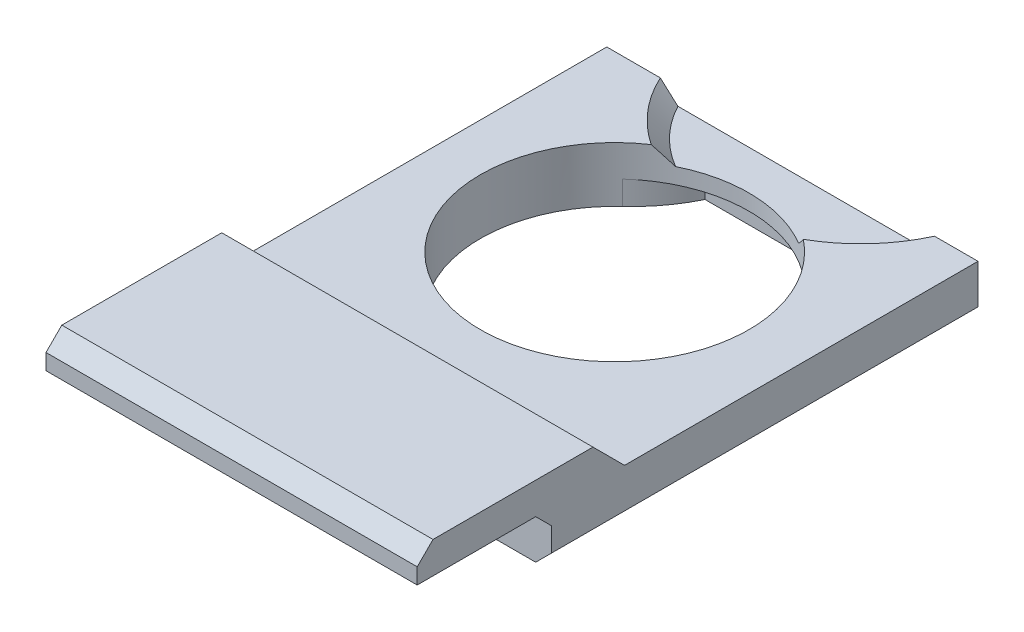
ISO-10303-21;
HEADER;
FILE_DESCRIPTION(('STEP AP214'),'2;1');
FILE_NAME('part.step','',(''),(''),'','','');
FILE_SCHEMA(('AUTOMOTIVE_DESIGN { 1 0 10303 214 1 1 1 1 }'));
ENDSEC;
DATA;
#1=APPLICATION_CONTEXT('core data for automotive mechanical design processes');
#2=APPLICATION_PROTOCOL_DEFINITION('international standard','automotive_design',2000,#1);
#3=PRODUCT_CONTEXT('',#1,'mechanical');
#4=PRODUCT('Part','Part','',(#3));
#5=PRODUCT_RELATED_PRODUCT_CATEGORY('part','',(#4));
#6=PRODUCT_DEFINITION_FORMATION('','',#4);
#7=PRODUCT_DEFINITION_CONTEXT('part definition',#1,'design');
#8=PRODUCT_DEFINITION('design','',#6,#7);
#9=PRODUCT_DEFINITION_SHAPE('','',#8);
#10=(LENGTH_UNIT() NAMED_UNIT(*) SI_UNIT(.MILLI.,.METRE.));
#11=(NAMED_UNIT(*) PLANE_ANGLE_UNIT() SI_UNIT($,.RADIAN.));
#12=(NAMED_UNIT(*) SI_UNIT($,.STERADIAN.) SOLID_ANGLE_UNIT());
#13=UNCERTAINTY_MEASURE_WITH_UNIT(LENGTH_MEASURE(1.E-05),#10,'distance_accuracy_value','');
#14=(GEOMETRIC_REPRESENTATION_CONTEXT(3) GLOBAL_UNCERTAINTY_ASSIGNED_CONTEXT((#13)) GLOBAL_UNIT_ASSIGNED_CONTEXT((#10,
#11,#12)) REPRESENTATION_CONTEXT('',''));
#15=CARTESIAN_POINT('',(0.,0.,0.));
#16=DIRECTION('',(0.,0.,1.));
#17=DIRECTION('',(1.,0.,0.));
#18=AXIS2_PLACEMENT_3D('',#15,#16,#17);
#19=CARTESIAN_POINT('',(-13.2043973941368,3.5,-11.1596091205212));
#20=DIRECTION('',(1.,0.,0.));
#21=DIRECTION('',(0.,0.,-1.));
#22=AXIS2_PLACEMENT_3D('',#19,#20,#21);
#23=PLANE('',#22);
#24=DIRECTION('',(0.,-1.,0.));
#25=VECTOR('',#24,1.);
#26=CARTESIAN_POINT('',(-13.2043973941368,5.5,25.3403908794788));
#27=LINE('',#26,#25);
#28=CARTESIAN_POINT('',(-13.2043973941368,4.50000000000001,25.3403908794788));
#29=VERTEX_POINT('',#28);
#30=CARTESIAN_POINT('',(-13.2043973941368,3.5,25.3403908794788));
#31=VERTEX_POINT('',#30);
#32=EDGE_CURVE('E177',#29,#31,#27,.T.);
#33=ORIENTED_EDGE('',*,*,#32,.F.);
#34=DIRECTION('',(0.,-0.707106781186545,0.70710678118655));
#35=VECTOR('',#34,1.);
#36=CARTESIAN_POINT('',(-13.2043973941368,4.5,25.3403908794788));
#37=LINE('',#36,#35);
#38=CARTESIAN_POINT('',(-13.2043973941368,5.5,24.3403908794788));
#39=VERTEX_POINT('',#38);
#40=EDGE_CURVE('E55',#29,#39,#37,.F.);
#41=ORIENTED_EDGE('',*,*,#40,.T.);
#42=DIRECTION('',(0.,0.,1.));
#43=VECTOR('',#42,1.);
#44=CARTESIAN_POINT('',(-13.2043973941368,5.5,14.2138990897864));
#45=LINE('',#44,#43);
#46=CARTESIAN_POINT('',(-13.2043973941368,5.5,14.2138990897864));
#47=VERTEX_POINT('',#46);
#48=EDGE_CURVE('E325',#47,#39,#45,.T.);
#49=ORIENTED_EDGE('',*,*,#48,.F.);
#50=DIRECTION('',(0.,-0.707106781186552,-0.707106781186543));
#51=VECTOR('',#50,1.);
#52=CARTESIAN_POINT('',(-13.2043973941368,-8.18675410515378,0.527144984632768));
#53=LINE('',#52,#51);
#54=CARTESIAN_POINT('',(-13.2043973941368,3.5,12.2138990897864));
#55=VERTEX_POINT('',#54);
#56=EDGE_CURVE('E190',#47,#55,#53,.T.);
#57=ORIENTED_EDGE('',*,*,#56,.T.);
#58=DIRECTION('',(0.,0.,1.));
#59=VECTOR('',#58,1.);
#60=CARTESIAN_POINT('',(-13.2043973941368,3.5,-11.1596091205212));
#61=LINE('',#60,#59);
#62=CARTESIAN_POINT('',(-13.2043973941368,3.5,-10.1596091205212));
#63=VERTEX_POINT('',#62);
#64=EDGE_CURVE('E183',#63,#55,#61,.T.);
#65=ORIENTED_EDGE('',*,*,#64,.F.);
#66=DIRECTION('',(0.,-1.,0.));
#67=VECTOR('',#66,1.);
#68=CARTESIAN_POINT('',(-13.2043973941368,3.5,-10.1596091205212));
#69=LINE('',#68,#67);
#70=CARTESIAN_POINT('',(-13.2043973941368,1.00000000000001,-10.1596091205212));
#71=VERTEX_POINT('',#70);
#72=EDGE_CURVE('E168',#63,#71,#69,.T.);
#73=ORIENTED_EDGE('',*,*,#72,.T.);
#74=DIRECTION('',(0.,0.,1.));
#75=VECTOR('',#74,1.);
#76=CARTESIAN_POINT('',(-13.2043973941368,1.00000000000001,-11.1596091205212));
#77=LINE('',#76,#75);
#78=CARTESIAN_POINT('',(-13.2043973941368,1.00000000000001,16.8403908794788));
#79=VERTEX_POINT('',#78);
#80=EDGE_CURVE('E209',#71,#79,#77,.T.);
#81=ORIENTED_EDGE('',*,*,#80,.T.);
#82=DIRECTION('',(0.,-1.,0.));
#83=VECTOR('',#82,1.);
#84=CARTESIAN_POINT('',(-13.2043973941368,3.5,16.8403908794788));
#85=LINE('',#84,#83);
#86=CARTESIAN_POINT('',(-13.2043973941368,2.50000000000001,16.8403908794788));
#87=VERTEX_POINT('',#86);
#88=EDGE_CURVE('E206',#87,#79,#85,.T.);
#89=ORIENTED_EDGE('',*,*,#88,.F.);
#90=DIRECTION('',(0.,-0.707106781186543,-0.707106781186552));
#91=VECTOR('',#90,1.);
#92=CARTESIAN_POINT('',(-13.2043973941368,-11.,3.34039087947863));
#93=LINE('',#92,#91);
#94=CARTESIAN_POINT('',(-13.2043973941368,3.5,17.8403908794788));
#95=VERTEX_POINT('',#94);
#96=EDGE_CURVE('E366',#87,#95,#93,.F.);
#97=ORIENTED_EDGE('',*,*,#96,.T.);
#98=DIRECTION('',(0.,0.,1.));
#99=VECTOR('',#98,1.);
#100=CARTESIAN_POINT('',(-13.2043973941368,3.5,14.2138990897864));
#101=LINE('',#100,#99);
#102=EDGE_CURVE('E306',#95,#31,#101,.T.);
#103=ORIENTED_EDGE('',*,*,#102,.T.);
#104=EDGE_LOOP('',(#33,#41,#49,#57,#65,#73,#81,#89,#97,#103));
#105=FACE_BOUND('',#104,.T.);
#106=ADVANCED_FACE('F33',(#105),#23,.F.);
#107=CARTESIAN_POINT('',(-13.2043973941368,3.5,16.8403908794788));
#108=DIRECTION('',(0.,0.,-1.));
#109=DIRECTION('',(-1.,0.,0.));
#110=AXIS2_PLACEMENT_3D('',#107,#108,#109);
#111=PLANE('',#110);
#112=DIRECTION('',(0.,-1.,0.));
#113=VECTOR('',#112,1.);
#114=CARTESIAN_POINT('',(10.2956026058632,3.5,16.8403908794788));
#115=LINE('',#114,#113);
#116=CARTESIAN_POINT('',(10.2956026058632,2.50000000000001,16.8403908794788));
#117=VERTEX_POINT('',#116);
#118=CARTESIAN_POINT('',(10.2956026058632,1.00000000000001,16.8403908794788));
#119=VERTEX_POINT('',#118);
#120=EDGE_CURVE('E196',#117,#119,#115,.T.);
#121=ORIENTED_EDGE('',*,*,#120,.F.);
#122=DIRECTION('',(-1.,0.,0.));
#123=VECTOR('',#122,1.);
#124=CARTESIAN_POINT('',(-13.2043973941368,2.50000000000001,16.8403908794788));
#125=LINE('',#124,#123);
#126=EDGE_CURVE('E362',#117,#87,#125,.T.);
#127=ORIENTED_EDGE('',*,*,#126,.T.);
#128=ORIENTED_EDGE('',*,*,#88,.T.);
#129=DIRECTION('',(-0.707106781186548,0.707106781186547,0.));
#130=VECTOR('',#129,1.);
#131=CARTESIAN_POINT('',(-13.2043973941368,1.00000000000001,16.8403908794788));
#132=LINE('',#131,#130);
#133=CARTESIAN_POINT('',(-12.2043973941368,0.,16.8403908794788));
#134=VERTEX_POINT('',#133);
#135=EDGE_CURVE('E214',#79,#134,#132,.F.);
#136=ORIENTED_EDGE('',*,*,#135,.T.);
#137=DIRECTION('',(1.,0.,0.));
#138=VECTOR('',#137,1.);
#139=CARTESIAN_POINT('',(-13.2043973941368,0.,16.8403908794788));
#140=LINE('',#139,#138);
#141=CARTESIAN_POINT('',(9.29560260586319,0.,16.8403908794788));
#142=VERTEX_POINT('',#141);
#143=EDGE_CURVE('E193',#134,#142,#140,.T.);
#144=ORIENTED_EDGE('',*,*,#143,.T.);
#145=DIRECTION('',(-0.707106781186547,-0.707106781186548,0.));
#146=VECTOR('',#145,1.);
#147=CARTESIAN_POINT('',(10.2956026058632,1.00000000000001,16.8403908794788));
#148=LINE('',#147,#146);
#149=EDGE_CURVE('E211',#142,#119,#148,.F.);
#150=ORIENTED_EDGE('',*,*,#149,.T.);
#151=EDGE_LOOP('',(#121,#127,#128,#136,#144,#150));
#152=FACE_BOUND('',#151,.T.);
#153=ADVANCED_FACE('F409',(#152),#111,.F.);
#154=CARTESIAN_POINT('',(10.2956026058632,3.5,-11.1596091205212));
#155=DIRECTION('',(-1.,0.,0.));
#156=DIRECTION('',(0.,0.,1.));
#157=AXIS2_PLACEMENT_3D('',#154,#155,#156);
#158=PLANE('',#157);
#159=DIRECTION('',(0.,0.,-1.));
#160=VECTOR('',#159,1.);
#161=CARTESIAN_POINT('',(10.2956026058632,5.5,14.2138990897864));
#162=LINE('',#161,#160);
#163=CARTESIAN_POINT('',(10.2956026058632,5.5,24.3403908794788));
#164=VERTEX_POINT('',#163);
#165=CARTESIAN_POINT('',(10.2956026058632,5.5,14.2138990897864));
#166=VERTEX_POINT('',#165);
#167=EDGE_CURVE('E327',#164,#166,#162,.T.);
#168=ORIENTED_EDGE('',*,*,#167,.F.);
#169=DIRECTION('',(0.,0.707106781186545,-0.70710678118655));
#170=VECTOR('',#169,1.);
#171=CARTESIAN_POINT('',(10.2956026058632,4.50000000000001,25.3403908794788));
#172=LINE('',#171,#170);
#173=CARTESIAN_POINT('',(10.2956026058632,4.50000000000001,25.3403908794788));
#174=VERTEX_POINT('',#173);
#175=EDGE_CURVE('E11',#164,#174,#172,.F.);
#176=ORIENTED_EDGE('',*,*,#175,.T.);
#177=DIRECTION('',(0.,1.,0.));
#178=VECTOR('',#177,1.);
#179=CARTESIAN_POINT('',(10.2956026058632,3.5,25.3403908794788));
#180=LINE('',#179,#178);
#181=CARTESIAN_POINT('',(10.2956026058632,3.5,25.3403908794788));
#182=VERTEX_POINT('',#181);
#183=EDGE_CURVE('E302',#182,#174,#180,.T.);
#184=ORIENTED_EDGE('',*,*,#183,.F.);
#185=DIRECTION('',(0.,0.,-1.));
#186=VECTOR('',#185,1.);
#187=CARTESIAN_POINT('',(10.2956026058632,3.5,14.2138990897864));
#188=LINE('',#187,#186);
#189=CARTESIAN_POINT('',(10.2956026058632,3.5,17.8403908794788));
#190=VERTEX_POINT('',#189);
#191=EDGE_CURVE('E328',#182,#190,#188,.T.);
#192=ORIENTED_EDGE('',*,*,#191,.T.);
#193=DIRECTION('',(0.,0.707106781186543,0.707106781186552));
#194=VECTOR('',#193,1.);
#195=CARTESIAN_POINT('',(10.2956026058632,-11.,3.34039087947863));
#196=LINE('',#195,#194);
#197=EDGE_CURVE('E364',#190,#117,#196,.F.);
#198=ORIENTED_EDGE('',*,*,#197,.T.);
#199=ORIENTED_EDGE('',*,*,#120,.T.);
#200=DIRECTION('',(0.,0.,-1.));
#201=VECTOR('',#200,1.);
#202=CARTESIAN_POINT('',(10.2956026058632,1.00000000000001,-11.1596091205212));
#203=LINE('',#202,#201);
#204=CARTESIAN_POINT('',(10.2956026058632,1.00000000000001,-10.1596091205212));
#205=VERTEX_POINT('',#204);
#206=EDGE_CURVE('E224',#119,#205,#203,.T.);
#207=ORIENTED_EDGE('',*,*,#206,.T.);
#208=DIRECTION('',(0.,1.,0.));
#209=VECTOR('',#208,1.);
#210=CARTESIAN_POINT('',(10.2956026058632,3.5,-10.1596091205212));
#211=LINE('',#210,#209);
#212=CARTESIAN_POINT('',(10.2956026058632,3.5,-10.1596091205212));
#213=VERTEX_POINT('',#212);
#214=EDGE_CURVE('E178',#205,#213,#211,.T.);
#215=ORIENTED_EDGE('',*,*,#214,.T.);
#216=DIRECTION('',(0.,0.,-1.));
#217=VECTOR('',#216,1.);
#218=CARTESIAN_POINT('',(10.2956026058632,3.5,-11.1596091205212));
#219=LINE('',#218,#217);
#220=CARTESIAN_POINT('',(10.2956026058632,3.5,12.2138990897864));
#221=VERTEX_POINT('',#220);
#222=EDGE_CURVE('E192',#221,#213,#219,.T.);
#223=ORIENTED_EDGE('',*,*,#222,.F.);
#224=DIRECTION('',(0.,0.707106781186552,0.707106781186543));
#225=VECTOR('',#224,1.);
#226=CARTESIAN_POINT('',(10.2956026058632,-8.18675410515378,0.527144984632768));
#227=LINE('',#226,#225);
#228=EDGE_CURVE('E354',#221,#166,#227,.T.);
#229=ORIENTED_EDGE('',*,*,#228,.T.);
#230=EDGE_LOOP('',(#168,#176,#184,#192,#198,#199,#207,#215,#223,#229));
#231=FACE_BOUND('',#230,.T.);
#232=ADVANCED_FACE('F416',(#231),#158,.F.);
#233=CARTESIAN_POINT('',(0.,3.5,0.));
#234=DIRECTION('',(0.,1.,0.));
#235=DIRECTION('',(0.,0.,1.));
#236=AXIS2_PLACEMENT_3D('',#233,#234,#235);
#237=PLANE('',#236);
#238=DIRECTION('',(1.,0.,0.));
#239=VECTOR('',#238,1.);
#240=CARTESIAN_POINT('',(-14.6352200640106,3.5,-10.1596091205212));
#241=LINE('',#240,#239);
#242=CARTESIAN_POINT('',(-9.81490170414816,3.5,-10.1596091205212));
#243=VERTEX_POINT('',#242);
#244=EDGE_CURVE('E171',#63,#243,#241,.T.);
#245=ORIENTED_EDGE('',*,*,#244,.F.);
#246=ORIENTED_EDGE('',*,*,#64,.T.);
#247=DIRECTION('',(1.,0.,0.));
#248=VECTOR('',#247,1.);
#249=CARTESIAN_POINT('',(0.,3.5,12.2138990897864));
#250=LINE('',#249,#248);
#251=EDGE_CURVE('E352',#55,#221,#250,.T.);
#252=ORIENTED_EDGE('',*,*,#251,.T.);
#253=ORIENTED_EDGE('',*,*,#222,.T.);
#254=CARTESIAN_POINT('',(7.54431576864198,3.5,-10.1596091205212));
#255=VERTEX_POINT('',#254);
#256=EDGE_CURVE('E188',#255,#213,#241,.T.);
#257=ORIENTED_EDGE('',*,*,#256,.F.);
#258=CARTESIAN_POINT('',(-1.13529296775309,3.5,-14.156160388649));
#259=DIRECTION('',(0.,1.,0.));
#260=DIRECTION('',(0.,0.,1.));
#261=AXIS2_PLACEMENT_3D('',#258,#259,#260);
#262=CIRCLE('',#261,9.55552352598639);
#263=CARTESIAN_POINT('',(3.55954339458981,3.5,-5.83350808385439));
#264=VERTEX_POINT('',#263);
#265=EDGE_CURVE('E336',#264,#255,#262,.T.);
#266=ORIENTED_EDGE('',*,*,#265,.F.);
#267=CARTESIAN_POINT('',(-1.7043973941368,3.5,0.84039087947883));
#268=DIRECTION('',(0.,1.,0.));
#269=DIRECTION('',(0.,0.,1.));
#270=AXIS2_PLACEMENT_3D('',#267,#268,#269);
#271=CIRCLE('',#270,8.5);
#272=CARTESIAN_POINT('',(-6.44739106245475,3.5,-6.2132614412906));
#273=VERTEX_POINT('',#272);
#274=EDGE_CURVE('E202',#273,#264,#271,.T.);
#275=ORIENTED_EDGE('',*,*,#274,.F.);
#276=EDGE_CURVE('E186',#243,#273,#262,.T.);
#277=ORIENTED_EDGE('',*,*,#276,.F.);
#278=EDGE_LOOP('',(#245,#246,#252,#253,#257,#266,#275,#277));
#279=FACE_BOUND('',#278,.T.);
#280=ADVANCED_FACE('F182',(#279),#237,.T.);
#281=CARTESIAN_POINT('',(0.,0.,0.));
#282=DIRECTION('',(0.,1.,0.));
#283=DIRECTION('',(0.,0.,1.));
#284=AXIS2_PLACEMENT_3D('',#281,#282,#283);
#285=PLANE('',#284);
#286=CARTESIAN_POINT('',(-1.7043973941368,0.,0.84039087947883));
#287=DIRECTION('',(0.,1.,0.));
#288=DIRECTION('',(0.,0.,1.));
#289=AXIS2_PLACEMENT_3D('',#286,#287,#288);
#290=CIRCLE('',#289,8.5);
#291=CARTESIAN_POINT('',(-7.45664462827733,0.,-5.41753623397676));
#292=VERTEX_POINT('',#291);
#293=CARTESIAN_POINT('',(4.40570664310773,0.,-5.06863853778151));
#294=VERTEX_POINT('',#293);
#295=EDGE_CURVE('E199',#292,#294,#290,.T.);
#296=ORIENTED_EDGE('',*,*,#295,.T.);
#297=CARTESIAN_POINT('',(11.5940643339836,0.,-12.0204378522054));
#298=DIRECTION('',(0.,1.,0.));
#299=DIRECTION('',(0.,0.,1.));
#300=AXIS2_PLACEMENT_3D('',#297,#298,#299);
#301=CIRCLE('',#300,10.);
#302=CARTESIAN_POINT('',(2.2706048550285,0.,-8.40476317874802));
#303=VERTEX_POINT('',#302);
#304=EDGE_CURVE('E378',#294,#303,#301,.F.);
#305=ORIENTED_EDGE('',*,*,#304,.T.);
#306=DIRECTION('',(1.,0.,0.));
#307=VECTOR('',#306,1.);
#308=CARTESIAN_POINT('',(-5.23182979117824,0.,-8.40476317874802));
#309=LINE('',#308,#307);
#310=CARTESIAN_POINT('',(-5.23182979117824,0.,-8.40476317874802));
#311=VERTEX_POINT('',#310);
#312=EDGE_CURVE('E314',#311,#303,#309,.T.);
#313=ORIENTED_EDGE('',*,*,#312,.F.);
#314=CARTESIAN_POINT('',(-14.2239943155015,0.,-12.7798034262775));
#315=DIRECTION('',(0.,1.,0.));
#316=DIRECTION('',(0.,0.,1.));
#317=AXIS2_PLACEMENT_3D('',#314,#315,#316);
#318=CIRCLE('',#317,10.);
#319=EDGE_CURVE('E376',#311,#292,#318,.F.);
#320=ORIENTED_EDGE('',*,*,#319,.T.);
#321=EDGE_LOOP('',(#296,#305,#313,#320));
#322=FACE_BOUND('',#321,.T.);
#323=ORIENTED_EDGE('',*,*,#143,.F.);
#324=DIRECTION('',(0.,0.,-1.));
#325=VECTOR('',#324,1.);
#326=CARTESIAN_POINT('',(-12.2043973941368,0.,0.));
#327=LINE('',#326,#325);
#328=CARTESIAN_POINT('',(-12.2043973941368,0.,-10.1596091205212));
#329=VERTEX_POINT('',#328);
#330=EDGE_CURVE('E221',#134,#329,#327,.T.);
#331=ORIENTED_EDGE('',*,*,#330,.T.);
#332=DIRECTION('',(1.,0.,0.));
#333=VECTOR('',#332,1.);
#334=CARTESIAN_POINT('',(0.,0.,-10.1596091205212));
#335=LINE('',#334,#333);
#336=CARTESIAN_POINT('',(9.29560260586318,0.,-10.1596091205212));
#337=VERTEX_POINT('',#336);
#338=EDGE_CURVE('E216',#329,#337,#335,.T.);
#339=ORIENTED_EDGE('',*,*,#338,.T.);
#340=DIRECTION('',(0.,0.,1.));
#341=VECTOR('',#340,1.);
#342=CARTESIAN_POINT('',(9.29560260586319,0.,0.));
#343=LINE('',#342,#341);
#344=EDGE_CURVE('E219',#337,#142,#343,.T.);
#345=ORIENTED_EDGE('',*,*,#344,.T.);
#346=EDGE_LOOP('',(#323,#331,#339,#345));
#347=FACE_BOUND('',#346,.T.);
#348=ADVANCED_FACE('F395',(#322,#347),#285,.F.);
#349=CARTESIAN_POINT('',(10.2956026058632,1.00000000000001,-11.1596091205212));
#350=DIRECTION('',(-0.707106781186548,0.707106781186547,0.));
#351=DIRECTION('',(0.,0.,-1.));
#352=AXIS2_PLACEMENT_3D('',#349,#350,#351);
#353=PLANE('',#352);
#354=DIRECTION('',(0.707106781186547,0.707106781186548,0.));
#355=VECTOR('',#354,1.);
#356=CARTESIAN_POINT('',(10.2956026058632,1.00000000000001,-10.1596091205212));
#357=LINE('',#356,#355);
#358=EDGE_CURVE('E431',#205,#337,#357,.F.);
#359=ORIENTED_EDGE('',*,*,#358,.F.);
#360=ORIENTED_EDGE('',*,*,#206,.F.);
#361=ORIENTED_EDGE('',*,*,#149,.F.);
#362=ORIENTED_EDGE('',*,*,#344,.F.);
#363=EDGE_LOOP('',(#359,#360,#361,#362));
#364=FACE_BOUND('',#363,.T.);
#365=ADVANCED_FACE('F261',(#364),#353,.F.);
#366=CARTESIAN_POINT('',(-13.2043973941368,1.00000000000001,-11.1596091205212));
#367=DIRECTION('',(0.707106781186547,0.707106781186548,0.));
#368=DIRECTION('',(0.,0.,1.));
#369=AXIS2_PLACEMENT_3D('',#366,#367,#368);
#370=PLANE('',#369);
#371=DIRECTION('',(0.707106781186548,-0.707106781186547,0.));
#372=VECTOR('',#371,1.);
#373=CARTESIAN_POINT('',(-13.2043973941368,1.00000000000001,-10.1596091205212));
#374=LINE('',#373,#372);
#375=EDGE_CURVE('E174',#329,#71,#374,.F.);
#376=ORIENTED_EDGE('',*,*,#375,.F.);
#377=ORIENTED_EDGE('',*,*,#330,.F.);
#378=ORIENTED_EDGE('',*,*,#135,.F.);
#379=ORIENTED_EDGE('',*,*,#80,.F.);
#380=EDGE_LOOP('',(#376,#377,#378,#379));
#381=FACE_BOUND('',#380,.T.);
#382=ADVANCED_FACE('F420',(#381),#370,.F.);
#383=CARTESIAN_POINT('',(-1.7043973941368,0.,0.84039087947883));
#384=DIRECTION('',(0.,1.,0.));
#385=DIRECTION('',(0.,0.,1.));
#386=AXIS2_PLACEMENT_3D('',#383,#384,#385);
#387=CYLINDRICAL_SURFACE('',#386,8.5);
#388=CARTESIAN_POINT('',(-1.7043973941368,1.5,0.84039087947883));
#389=DIRECTION('',(0.,-1.,0.));
#390=DIRECTION('',(0.,0.,-1.));
#391=AXIS2_PLACEMENT_3D('',#388,#389,#390);
#392=CIRCLE('',#391,8.5);
#393=CARTESIAN_POINT('',(4.40570664310773,1.5,-5.06863853778151));
#394=VERTEX_POINT('',#393);
#395=CARTESIAN_POINT('',(-7.45664462827733,1.5,-5.41753623397676));
#396=VERTEX_POINT('',#395);
#397=EDGE_CURVE('E368',#394,#396,#392,.F.);
#398=ORIENTED_EDGE('',*,*,#397,.F.);
#399=DIRECTION('',(0.,1.,0.));
#400=VECTOR('',#399,1.);
#401=CARTESIAN_POINT('',(4.40570664310773,0.,-5.06863853778151));
#402=LINE('',#401,#400);
#403=EDGE_CURVE('E373',#394,#294,#402,.F.);
#404=ORIENTED_EDGE('',*,*,#403,.T.);
#405=ORIENTED_EDGE('',*,*,#295,.F.);
#406=DIRECTION('',(0.,1.,0.));
#407=VECTOR('',#406,1.);
#408=CARTESIAN_POINT('',(-7.45664462827733,0.,-5.41753623397677));
#409=LINE('',#408,#407);
#410=EDGE_CURVE('E370',#292,#396,#409,.T.);
#411=ORIENTED_EDGE('',*,*,#410,.T.);
#412=EDGE_LOOP('',(#398,#404,#405,#411));
#413=FACE_BOUND('',#412,.T.);
#414=CARTESIAN_POINT('',(-1.7043973941368,2.5,0.84039087947883));
#415=DIRECTION('',(0.,1.,0.));
#416=DIRECTION('',(0.,0.,1.));
#417=AXIS2_PLACEMENT_3D('',#414,#415,#416);
#418=CIRCLE('',#417,8.5);
#419=CARTESIAN_POINT('',(-5.46996487151153,2.5,-6.7800094757084));
#420=VERTEX_POINT('',#419);
#421=CARTESIAN_POINT('',(2.62788160012487,2.5,-6.472704136715));
#422=VERTEX_POINT('',#421);
#423=EDGE_CURVE('E227',#420,#422,#418,.F.);
#424=ORIENTED_EDGE('',*,*,#423,.F.);
#425=CARTESIAN_POINT('',(-5.46996487151153,2.5,-6.7800094757084));
#426=CARTESIAN_POINT('',(-5.5565180628324,2.5807372621746,-6.73723590520001));
#427=CARTESIAN_POINT('',(-5.64173468220181,2.66227915489309,-6.69329587227077));
#428=CARTESIAN_POINT('',(-5.80953683062387,2.82668126865164,-6.60319074845282));
#429=CARTESIAN_POINT('',(-5.8921243465626,2.9095404196041,-6.55702740743434));
#430=CARTESIAN_POINT('',(-6.05484211397301,3.07640986642587,-6.46251819375757));
#431=CARTESIAN_POINT('',(-6.13497242522833,3.16042013421651,-6.41417237426971));
#432=CARTESIAN_POINT('',(-6.29291715507688,3.32948536183602,-6.31531752007123));
#433=CARTESIAN_POINT('',(-6.37072973069077,3.41454108085537,-6.26480683787722));
#434=CARTESIAN_POINT('',(-6.44739106245475,3.49999999999999,-6.2132614412906));
#435=B_SPLINE_CURVE_WITH_KNOTS('',3,(#425,#426,#427,#428,#429,#430,#431,#432,#433,#434),
.UNSPECIFIED.,.F.,.F.,(4,2,2,2,4),(0.,0.377541116833015,0.754789794255524,1.1320292859479,
1.50956114354248),.UNSPECIFIED.);
#436=EDGE_CURVE('E243',#420,#273,#435,.T.);
#437=ORIENTED_EDGE('',*,*,#436,.T.);
#438=ORIENTED_EDGE('',*,*,#274,.T.);
#439=CARTESIAN_POINT('',(3.55954339458982,3.50000000000001,-5.83350808385439));
#440=CARTESIAN_POINT('',(3.48700911820646,3.41454108085538,-5.89071530758217));
#441=CARTESIAN_POINT('',(3.41324848922202,3.32948536183603,-5.94697804437299));
#442=CARTESIAN_POINT('',(3.26325012659319,3.16042013421652,-6.05751903719559));
#443=CARTESIAN_POINT('',(3.18701435548847,3.07640986642588,-6.11179879629506));
#444=CARTESIAN_POINT('',(3.03192733180787,2.90954041960411,-6.21836839039544));
#445=CARTESIAN_POINT('',(2.95307601559056,2.82668126865165,-6.27065817690979));
#446=CARTESIAN_POINT('',(2.79258545305707,2.66227915489309,-6.37322168743372));
#447=CARTESIAN_POINT('',(2.71094409294859,2.5807372621746,-6.4234938171898));
#448=CARTESIAN_POINT('',(2.62788160012487,2.5,-6.472704136715));
#449=B_SPLINE_CURVE_WITH_KNOTS('',3,(#439,#440,#441,#442,#443,#444,#445,#446,#447,#448),
.UNSPECIFIED.,.F.,.F.,(4,2,2,2,4),(0.,0.377531857594592,0.754771349286969,1.13202002670948,
1.5095611435425),.UNSPECIFIED.);
#450=EDGE_CURVE('E235',#264,#422,#449,.T.);
#451=ORIENTED_EDGE('',*,*,#450,.T.);
#452=EDGE_LOOP('',(#424,#437,#438,#451));
#453=FACE_BOUND('',#452,.T.);
#454=ADVANCED_FACE('F250',(#413,#453),#387,.F.);
#455=CARTESIAN_POINT('',(-1.13529296775309,2.5,-14.156160388649));
#456=DIRECTION('',(0.,1.,0.));
#457=DIRECTION('',(0.,0.,1.));
#458=AXIS2_PLACEMENT_3D('',#455,#456,#457);
#459=PLANE('',#458);
#460=DIRECTION('',(1.,0.,0.));
#461=VECTOR('',#460,1.);
#462=CARTESIAN_POINT('',(-1.13529296775309,2.5,-10.1596091205212));
#463=LINE('',#462,#461);
#464=CARTESIAN_POINT('',(-8.69998468420345,2.5,-10.1596091205212));
#465=VERTEX_POINT('',#464);
#466=CARTESIAN_POINT('',(6.42939874869726,2.5,-10.1596091205212));
#467=VERTEX_POINT('',#466);
#468=EDGE_CURVE('E187',#465,#467,#463,.T.);
#469=ORIENTED_EDGE('',*,*,#468,.F.);
#470=CARTESIAN_POINT('',(-1.13529296775309,2.5,-14.156160388649));
#471=DIRECTION('',(0.,1.,0.));
#472=DIRECTION('',(0.,0.,1.));
#473=AXIS2_PLACEMENT_3D('',#470,#471,#472);
#474=CIRCLE('',#473,8.55552352598639);
#475=EDGE_CURVE('E230',#465,#420,#474,.T.);
#476=ORIENTED_EDGE('',*,*,#475,.T.);
#477=ORIENTED_EDGE('',*,*,#423,.T.);
#478=CARTESIAN_POINT('',(-1.13529296775309,2.5,-14.156160388649));
#479=DIRECTION('',(0.,1.,0.));
#480=DIRECTION('',(0.,0.,1.));
#481=AXIS2_PLACEMENT_3D('',#478,#479,#480);
#482=CIRCLE('',#481,8.55552352598638);
#483=EDGE_CURVE('E232',#422,#467,#482,.T.);
#484=ORIENTED_EDGE('',*,*,#483,.T.);
#485=EDGE_LOOP('',(#469,#476,#477,#484));
#486=FACE_BOUND('',#485,.T.);
#487=ADVANCED_FACE('F259',(#486),#459,.T.);
#488=CARTESIAN_POINT('',(-1.13529296775309,2.5,-14.156160388649));
#489=DIRECTION('',(0.,1.,0.));
#490=DIRECTION('',(0.,0.,1.));
#491=AXIS2_PLACEMENT_3D('',#488,#489,#490);
#492=CONICAL_SURFACE('',#491,8.55552352598638,0.785398163397453);
#493=ORIENTED_EDGE('',*,*,#265,.T.);
#494=CARTESIAN_POINT('',(13.7188372006737,9.32685616960494,-10.1596091205212));
#495=CARTESIAN_POINT('',(13.4182541457885,9.03660730458298,-10.1596091205212));
#496=CARTESIAN_POINT('',(13.1173848433068,8.7466541174739,-10.1596091205212));
#497=CARTESIAN_POINT('',(12.5149306242305,8.16748780255645,-10.1596091205212));
#498=CARTESIAN_POINT('',(12.2133457023688,7.87827468022789,-10.1596091205212));
#499=CARTESIAN_POINT('',(11.6092560738988,7.30067887470176,-10.1596091205212));
#500=CARTESIAN_POINT('',(11.3067511820307,7.01229638516827,-10.1596091205212));
#501=CARTESIAN_POINT('',(10.7006943567166,6.43663505306381,-10.1596091205212));
#502=CARTESIAN_POINT('',(10.3971424265138,6.1493562070803,-10.1596091205212));
#503=CARTESIAN_POINT('',(9.78913255136098,5.5765489420484,-10.1596091205212));
#504=CARTESIAN_POINT('',(9.48467628975255,5.29101873738336,-10.1596091205212));
#505=CARTESIAN_POINT('',(8.8741297946306,4.72171108678027,-10.1596091205212));
#506=CARTESIAN_POINT('',(8.56803956705258,4.43793363448328,-10.1596091205212));
#507=CARTESIAN_POINT('',(7.95377740241611,3.87267681481564,-10.1596091205212));
#508=CARTESIAN_POINT('',(7.64560559611549,3.59119730550457,-10.1596091205212));
#509=CARTESIAN_POINT('',(7.02651377054296,3.03128043392776,-10.1596091205212));
#510=CARTESIAN_POINT('',(6.71559380136589,2.75284301641535,-10.1596091205212));
#511=CARTESIAN_POINT('',(6.18067761977536,2.2802463804007,-10.1596091205212));
#512=CARTESIAN_POINT('',(5.95760186881759,2.08504652406878,-10.1596091205212));
#513=CARTESIAN_POINT('',(5.50909900535452,1.69738738465259,-10.1596091205212));
#514=CARTESIAN_POINT('',(5.28367202145482,1.5049279530229,-10.1596091205212));
#515=CARTESIAN_POINT('',(4.82970062731505,1.12349982745487,-10.1596091205212));
#516=CARTESIAN_POINT('',(4.60115487962106,0.934532718528947,-10.1596091205212));
#517=CARTESIAN_POINT('',(4.25537134354047,0.654701139889275,-10.1596091205212));
#518=CARTESIAN_POINT('',(4.13960513549191,0.562018697799763,-10.1596091205212));
#519=CARTESIAN_POINT('',(3.90692982437468,0.378090203847372,-10.1596091205212));
#520=CARTESIAN_POINT('',(3.79002067217559,0.286844214175631,-10.1596091205212));
#521=CARTESIAN_POINT('',(3.67246435824241,0.196432371525811,-10.1596091205212));
#522=B_SPLINE_CURVE_WITH_KNOTS('',3,(#494,#495,#496,#497,#498,#499,#500,#501,#502,#503,#504,
#505,#506,#507,#508,#509,#510,#511,#512,#513,#514,#515,#516,#517,#518,#519,#520,#521),
.UNSPECIFIED.,.F.,.F.,(4,2,2,2,2,2,2,2,2,2,2,2,2,4),(0.,1.2535360639377,2.50708138297248,
3.76089851155786,5.01471176012613,6.26690058836553,7.51908487102636,8.77119121390975,
10.0232747796808,10.9125226348265,11.8017221031485,12.691315692213,13.1361950352099,
13.5810935865571),.UNSPECIFIED.);
#523=EDGE_CURVE('E267',#255,#467,#522,.T.);
#524=ORIENTED_EDGE('',*,*,#523,.T.);
#525=ORIENTED_EDGE('',*,*,#483,.F.);
#526=ORIENTED_EDGE('',*,*,#450,.F.);
#527=EDGE_LOOP('',(#493,#524,#525,#526));
#528=FACE_BOUND('',#527,.T.);
#529=ADVANCED_FACE('F254',(#528),#492,.F.);
#530=CARTESIAN_POINT('',(-1.13529296775309,2.5,-14.156160388649));
#531=DIRECTION('',(0.,1.,0.));
#532=DIRECTION('',(0.,0.,1.));
#533=AXIS2_PLACEMENT_3D('',#530,#531,#532);
#534=CONICAL_SURFACE('',#533,8.55552352598639,0.785398163397455);
#535=ORIENTED_EDGE('',*,*,#475,.F.);
#536=CARTESIAN_POINT('',(-4.96156815910544,-0.522639659616814,-10.1596091205212));
#537=CARTESIAN_POINT('',(-5.06152022000167,-0.453507907304835,-10.1596091205212));
#538=CARTESIAN_POINT('',(-5.16081558047101,-0.383437610183905,-10.1596091205212));
#539=CARTESIAN_POINT('',(-5.35822918008628,-0.241671902989106,-10.1596091205212));
#540=CARTESIAN_POINT('',(-5.45634750575032,-0.169976613493818,-10.1596091205212));
#541=CARTESIAN_POINT('',(-5.74910405430971,0.0471404444856463,-10.1596091205212));
#542=CARTESIAN_POINT('',(-5.94220437470782,0.194635685919958,-10.1596091205212));
#543=CARTESIAN_POINT('',(-6.32501577683474,0.493629108699938,-10.1596091205212));
#544=CARTESIAN_POINT('',(-6.51472942266052,0.645124025900517,-10.1596091205212));
#545=CARTESIAN_POINT('',(-6.89159957319173,0.951288994679016,-10.1596091205212));
#546=CARTESIAN_POINT('',(-7.07875585010499,1.10595932606894,-10.1596091205212));
#547=CARTESIAN_POINT('',(-7.45078675536025,1.41760010013503,-10.1596091205212));
#548=CARTESIAN_POINT('',(-7.63566367882687,1.57456780890091,-10.1596091205212));
#549=CARTESIAN_POINT('',(-8.00371774752367,1.89046876207005,-10.1596091205212));
#550=CARTESIAN_POINT('',(-8.18689494547931,2.04940194514516,-10.1596091205212));
#551=CARTESIAN_POINT('',(-8.73444032630152,2.52865406209591,-10.1596091205212));
#552=CARTESIAN_POINT('',(-9.09672978856385,2.85134738501951,-10.1596091205212));
#553=CARTESIAN_POINT('',(-9.73680771029181,3.42835694204704,-10.1596091205212));
#554=CARTESIAN_POINT('',(-10.0153688189189,3.68182037678332,-10.1596091205212));
#555=CARTESIAN_POINT('',(-10.5706561304142,4.19075072271345,-10.1596091205212));
#556=CARTESIAN_POINT('',(-10.8473823285954,4.44621763902132,-10.1596091205212));
#557=CARTESIAN_POINT('',(-11.3993563321361,4.95869138458264,-10.1596091205212));
#558=CARTESIAN_POINT('',(-11.6746042698894,5.2156980714202,-10.1596091205212));
#559=CARTESIAN_POINT('',(-12.2239288191568,5.73096044830942,-10.1596091205212));
#560=CARTESIAN_POINT('',(-12.4980054288138,5.98921614033989,-10.1596091205212));
#561=CARTESIAN_POINT('',(-13.0455936987345,6.50711032029427,-10.1596091205212));
#562=CARTESIAN_POINT('',(-13.3191039850124,6.76675026020031,-10.1596091205212));
#563=CARTESIAN_POINT('',(-13.8653303244618,7.28686452313613,-10.1596091205212));
#564=CARTESIAN_POINT('',(-14.1380463768086,7.5473388470318,-10.1596091205212));
#565=CARTESIAN_POINT('',(-14.6828217585344,8.06898637183014,-10.1596091205212));
#566=CARTESIAN_POINT('',(-14.9548810717322,8.3301595896249,-10.1596091205212));
#567=CARTESIAN_POINT('',(-15.4984342275984,8.85309182327097,-10.1596091205212));
#568=CARTESIAN_POINT('',(-15.7699280723899,9.11485083691524,-10.1596091205212));
#569=CARTESIAN_POINT('',(-16.0411891701191,9.37685035603449,-10.1596091205212));
#570=B_SPLINE_CURVE_WITH_KNOTS('',3,(#536,#537,#538,#539,#540,#541,#542,#543,#544,#545,#546,
#547,#548,#549,#550,#551,#552,#553,#554,#555,#556,#557,#558,#559,#560,#561,#562,#563,#564,#565,
#566,#567,#568,#569),.UNSPECIFIED.,.F.,.F.,(4,2,2,2,2,2,2,2,2,2,2,2,2,2,2,2,4),(0.,
0.364576001858116,0.729125039243141,1.45800170823655,2.18630088355885,2.91466451316352,
3.64222235513475,4.3697575523182,5.8251912434855,6.95503225898754,8.08487615943273,
9.21461712422456,10.3443598794654,11.4757228942356,12.607087083464,13.7384788690293,
14.8698663991319),.UNSPECIFIED.);
#571=EDGE_CURVE('E284',#465,#243,#570,.T.);
#572=ORIENTED_EDGE('',*,*,#571,.T.);
#573=ORIENTED_EDGE('',*,*,#276,.T.);
#574=ORIENTED_EDGE('',*,*,#436,.F.);
#575=EDGE_LOOP('',(#535,#572,#573,#574));
#576=FACE_BOUND('',#575,.T.);
#577=ADVANCED_FACE('F258',(#576),#534,.F.);
#578=CARTESIAN_POINT('',(0.,3.5,0.));
#579=DIRECTION('',(0.,1.,0.));
#580=DIRECTION('',(0.,0.,1.));
#581=AXIS2_PLACEMENT_3D('',#578,#579,#580);
#582=PLANE('',#581);
#583=ORIENTED_EDGE('',*,*,#102,.F.);
#584=DIRECTION('',(1.,0.,0.));
#585=VECTOR('',#584,1.);
#586=CARTESIAN_POINT('',(10.2956026058632,3.5,17.8403908794788));
#587=LINE('',#586,#585);
#588=EDGE_CURVE('E359',#95,#190,#587,.T.);
#589=ORIENTED_EDGE('',*,*,#588,.T.);
#590=ORIENTED_EDGE('',*,*,#191,.F.);
#591=DIRECTION('',(1.,0.,0.));
#592=VECTOR('',#591,1.);
#593=CARTESIAN_POINT('',(-13.2043973941368,3.5,25.3403908794788));
#594=LINE('',#593,#592);
#595=EDGE_CURVE('E308',#31,#182,#594,.T.);
#596=ORIENTED_EDGE('',*,*,#595,.F.);
#597=EDGE_LOOP('',(#583,#589,#590,#596));
#598=FACE_BOUND('',#597,.T.);
#599=ADVANCED_FACE('F447',(#598),#582,.F.);
#600=CARTESIAN_POINT('',(0.,5.5,0.));
#601=DIRECTION('',(0.,1.,0.));
#602=DIRECTION('',(0.,0.,1.));
#603=AXIS2_PLACEMENT_3D('',#600,#601,#602);
#604=PLANE('',#603);
#605=ORIENTED_EDGE('',*,*,#48,.T.);
#606=DIRECTION('',(1.,0.,0.));
#607=VECTOR('',#606,1.);
#608=CARTESIAN_POINT('',(0.,5.5,24.3403908794788));
#609=LINE('',#608,#607);
#610=EDGE_CURVE('E41',#39,#164,#609,.T.);
#611=ORIENTED_EDGE('',*,*,#610,.T.);
#612=ORIENTED_EDGE('',*,*,#167,.T.);
#613=DIRECTION('',(-1.,0.,0.));
#614=VECTOR('',#613,1.);
#615=CARTESIAN_POINT('',(-13.2043973941368,5.5,14.2138990897864));
#616=LINE('',#615,#614);
#617=EDGE_CURVE('E330',#166,#47,#616,.T.);
#618=ORIENTED_EDGE('',*,*,#617,.T.);
#619=EDGE_LOOP('',(#605,#611,#612,#618));
#620=FACE_BOUND('',#619,.T.);
#621=ADVANCED_FACE('F467',(#620),#604,.T.);
#622=CARTESIAN_POINT('',(-13.2043973941368,5.50000000000002,14.2138990897864));
#623=DIRECTION('',(0.,-0.707106781186543,0.707106781186552));
#624=DIRECTION('',(-1.,0.,0.));
#625=AXIS2_PLACEMENT_3D('',#622,#623,#624);
#626=PLANE('',#625);
#627=ORIENTED_EDGE('',*,*,#228,.F.);
#628=ORIENTED_EDGE('',*,*,#251,.F.);
#629=ORIENTED_EDGE('',*,*,#56,.F.);
#630=ORIENTED_EDGE('',*,*,#617,.F.);
#631=EDGE_LOOP('',(#627,#628,#629,#630));
#632=FACE_BOUND('',#631,.T.);
#633=ADVANCED_FACE('F470',(#632),#626,.F.);
#634=CARTESIAN_POINT('',(0.,3.5,17.8403908794788));
#635=DIRECTION('',(0.,-0.707106781186552,0.707106781186543));
#636=DIRECTION('',(-1.,0.,0.));
#637=AXIS2_PLACEMENT_3D('',#634,#635,#636);
#638=PLANE('',#637);
#639=ORIENTED_EDGE('',*,*,#96,.F.);
#640=ORIENTED_EDGE('',*,*,#126,.F.);
#641=ORIENTED_EDGE('',*,*,#197,.F.);
#642=ORIENTED_EDGE('',*,*,#588,.F.);
#643=EDGE_LOOP('',(#639,#640,#641,#642));
#644=FACE_BOUND('',#643,.T.);
#645=ADVANCED_FACE('F444',(#644),#638,.T.);
#646=CARTESIAN_POINT('',(0.,1.5,0.));
#647=DIRECTION('',(0.,-1.,0.));
#648=DIRECTION('',(0.,0.,-1.));
#649=AXIS2_PLACEMENT_3D('',#646,#647,#648);
#650=PLANE('',#649);
#651=ORIENTED_EDGE('',*,*,#397,.T.);
#652=CARTESIAN_POINT('',(-14.2239943155015,1.5,-12.7798034262775));
#653=DIRECTION('',(0.,-1.,0.));
#654=DIRECTION('',(0.,0.,-1.));
#655=AXIS2_PLACEMENT_3D('',#652,#653,#654);
#656=CIRCLE('',#655,10.);
#657=CARTESIAN_POINT('',(-5.23182979117824,1.5,-8.40476317874802));
#658=VERTEX_POINT('',#657);
#659=EDGE_CURVE('E292',#396,#658,#656,.F.);
#660=ORIENTED_EDGE('',*,*,#659,.T.);
#661=DIRECTION('',(1.,0.,0.));
#662=VECTOR('',#661,1.);
#663=CARTESIAN_POINT('',(-5.23182979117824,1.5,-8.40476317874802));
#664=LINE('',#663,#662);
#665=CARTESIAN_POINT('',(2.2706048550285,1.5,-8.40476317874802));
#666=VERTEX_POINT('',#665);
#667=EDGE_CURVE('E315',#658,#666,#664,.T.);
#668=ORIENTED_EDGE('',*,*,#667,.T.);
#669=CARTESIAN_POINT('',(11.5940643339836,1.5,-12.0204378522054));
#670=DIRECTION('',(0.,-1.,0.));
#671=DIRECTION('',(0.,0.,-1.));
#672=AXIS2_PLACEMENT_3D('',#669,#670,#671);
#673=CIRCLE('',#672,10.);
#674=EDGE_CURVE('E379',#666,#394,#673,.F.);
#675=ORIENTED_EDGE('',*,*,#674,.T.);
#676=EDGE_LOOP('',(#651,#660,#668,#675));
#677=FACE_BOUND('',#676,.T.);
#678=ADVANCED_FACE('F386',(#677),#650,.T.);
#679=CARTESIAN_POINT('',(-5.23182979117824,1.5,-8.40476317874802));
#680=DIRECTION('',(0.,0.,-1.));
#681=DIRECTION('',(-1.,0.,0.));
#682=AXIS2_PLACEMENT_3D('',#679,#680,#681);
#683=PLANE('',#682);
#684=ORIENTED_EDGE('',*,*,#312,.T.);
#685=DIRECTION('',(0.,-1.,0.));
#686=VECTOR('',#685,1.);
#687=CARTESIAN_POINT('',(2.2706048550285,1.5,-8.40476317874802));
#688=LINE('',#687,#686);
#689=EDGE_CURVE('E321',#666,#303,#688,.T.);
#690=ORIENTED_EDGE('',*,*,#689,.F.);
#691=ORIENTED_EDGE('',*,*,#667,.F.);
#692=DIRECTION('',(0.,-1.,0.));
#693=VECTOR('',#692,1.);
#694=CARTESIAN_POINT('',(-5.23182979117824,1.5,-8.40476317874802));
#695=LINE('',#694,#693);
#696=EDGE_CURVE('E318',#658,#311,#695,.T.);
#697=ORIENTED_EDGE('',*,*,#696,.T.);
#698=EDGE_LOOP('',(#684,#690,#691,#697));
#699=FACE_BOUND('',#698,.T.);
#700=ADVANCED_FACE('F391',(#699),#683,.F.);
#701=CARTESIAN_POINT('',(11.5940643339836,1.5,-12.0204378522054));
#702=DIRECTION('',(0.,-1.,0.));
#703=DIRECTION('',(0.,0.,-1.));
#704=AXIS2_PLACEMENT_3D('',#701,#702,#703);
#705=CYLINDRICAL_SURFACE('',#704,10.);
#706=ORIENTED_EDGE('',*,*,#674,.F.);
#707=ORIENTED_EDGE('',*,*,#689,.T.);
#708=ORIENTED_EDGE('',*,*,#304,.F.);
#709=ORIENTED_EDGE('',*,*,#403,.F.);
#710=EDGE_LOOP('',(#706,#707,#708,#709));
#711=FACE_BOUND('',#710,.T.);
#712=ADVANCED_FACE('F399',(#711),#705,.T.);
#713=CARTESIAN_POINT('',(-14.2239943155015,1.5,-12.7798034262775));
#714=DIRECTION('',(0.,1.,0.));
#715=DIRECTION('',(0.,0.,1.));
#716=AXIS2_PLACEMENT_3D('',#713,#714,#715);
#717=CYLINDRICAL_SURFACE('',#716,10.);
#718=ORIENTED_EDGE('',*,*,#319,.F.);
#719=ORIENTED_EDGE('',*,*,#696,.F.);
#720=ORIENTED_EDGE('',*,*,#659,.F.);
#721=ORIENTED_EDGE('',*,*,#410,.F.);
#722=EDGE_LOOP('',(#718,#719,#720,#721));
#723=FACE_BOUND('',#722,.T.);
#724=ADVANCED_FACE('F394',(#723),#717,.T.);
#725=CARTESIAN_POINT('',(0.,0.,25.3403908794788));
#726=DIRECTION('',(0.,0.,1.));
#727=DIRECTION('',(1.,0.,0.));
#728=AXIS2_PLACEMENT_3D('',#725,#726,#727);
#729=PLANE('',#728);
#730=ORIENTED_EDGE('',*,*,#183,.T.);
#731=DIRECTION('',(-1.,0.,0.));
#732=VECTOR('',#731,1.);
#733=CARTESIAN_POINT('',(0.,4.50000000000001,25.3403908794788));
#734=LINE('',#733,#732);
#735=EDGE_CURVE('E291',#174,#29,#734,.T.);
#736=ORIENTED_EDGE('',*,*,#735,.T.);
#737=ORIENTED_EDGE('',*,*,#32,.T.);
#738=ORIENTED_EDGE('',*,*,#595,.T.);
#739=EDGE_LOOP('',(#730,#736,#737,#738));
#740=FACE_BOUND('',#739,.T.);
#741=ADVANCED_FACE('F280',(#740),#729,.T.);
#742=CARTESIAN_POINT('',(-14.6352200640106,-3.5,-10.1596091205212));
#743=DIRECTION('',(0.,0.,1.));
#744=DIRECTION('',(1.,0.,0.));
#745=AXIS2_PLACEMENT_3D('',#742,#743,#744);
#746=PLANE('',#745);
#747=ORIENTED_EDGE('',*,*,#244,.T.);
#748=ORIENTED_EDGE('',*,*,#571,.F.);
#749=ORIENTED_EDGE('',*,*,#468,.T.);
#750=ORIENTED_EDGE('',*,*,#523,.F.);
#751=ORIENTED_EDGE('',*,*,#256,.T.);
#752=ORIENTED_EDGE('',*,*,#214,.F.);
#753=ORIENTED_EDGE('',*,*,#358,.T.);
#754=ORIENTED_EDGE('',*,*,#338,.F.);
#755=ORIENTED_EDGE('',*,*,#375,.T.);
#756=ORIENTED_EDGE('',*,*,#72,.F.);
#757=EDGE_LOOP('',(#747,#748,#749,#750,#751,#752,#753,#754,#755,#756));
#758=FACE_BOUND('',#757,.T.);
#759=ADVANCED_FACE('F170',(#758),#746,.F.);
#760=CARTESIAN_POINT('',(0.,4.50000000000001,25.3403908794788));
#761=DIRECTION('',(0.,-0.70710678118655,-0.707106781186545));
#762=DIRECTION('',(-1.,0.,0.));
#763=AXIS2_PLACEMENT_3D('',#760,#761,#762);
#764=PLANE('',#763);
#765=ORIENTED_EDGE('',*,*,#175,.F.);
#766=ORIENTED_EDGE('',*,*,#610,.F.);
#767=ORIENTED_EDGE('',*,*,#40,.F.);
#768=ORIENTED_EDGE('',*,*,#735,.F.);
#769=EDGE_LOOP('',(#765,#766,#767,#768));
#770=FACE_BOUND('',#769,.T.);
#771=ADVANCED_FACE('F35',(#770),#764,.F.);
#772=CLOSED_SHELL('',(#106,#153,#232,#280,#348,#365,#382,#454,#487,#529,#577,#599,#621,#633,
#645,#678,#700,#712,#724,#741,#759,#771));
#773=MANIFOLD_SOLID_BREP('B2',#772);
#774=ADVANCED_BREP_SHAPE_REPRESENTATION('',(#18,#773),#14);
#775=SHAPE_DEFINITION_REPRESENTATION(#9,#774);
ENDSEC;
END-ISO-10303-21;
